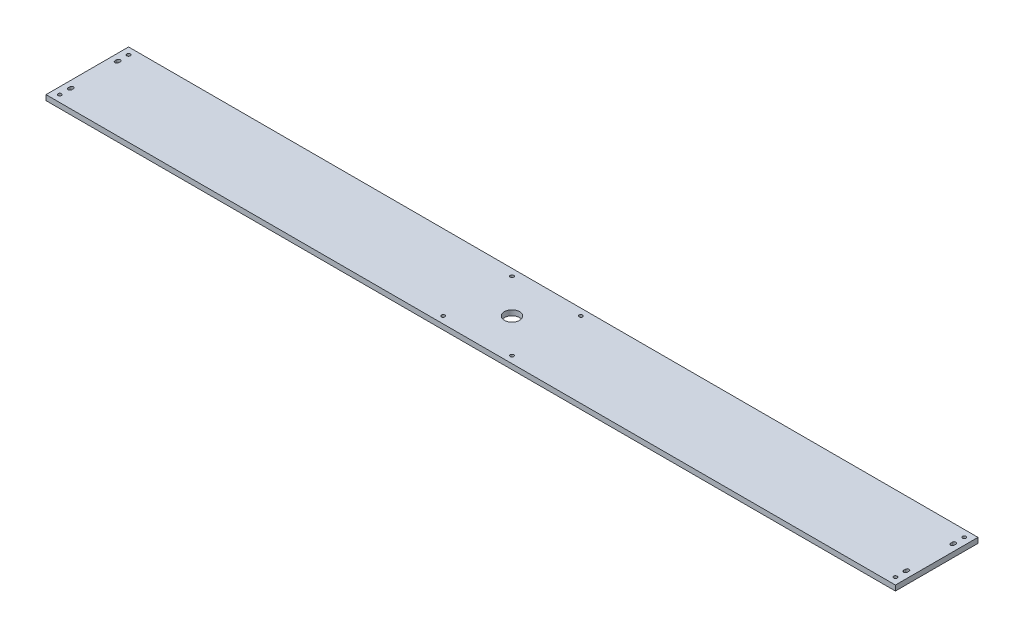
ISO-10303-21;
HEADER;
FILE_DESCRIPTION(('STEP AP214'),'2;1');
FILE_NAME('part.step','',(''),(''),'','','');
FILE_SCHEMA(('AUTOMOTIVE_DESIGN { 1 0 10303 214 1 1 1 1 }'));
ENDSEC;
DATA;
#1=APPLICATION_CONTEXT('core data for automotive mechanical design processes');
#2=APPLICATION_PROTOCOL_DEFINITION('international standard','automotive_design',2000,#1);
#3=PRODUCT_CONTEXT('',#1,'mechanical');
#4=PRODUCT('Part','Part','',(#3));
#5=PRODUCT_RELATED_PRODUCT_CATEGORY('part','',(#4));
#6=PRODUCT_DEFINITION_FORMATION('','',#4);
#7=PRODUCT_DEFINITION_CONTEXT('part definition',#1,'design');
#8=PRODUCT_DEFINITION('design','',#6,#7);
#9=PRODUCT_DEFINITION_SHAPE('','',#8);
#10=(LENGTH_UNIT() NAMED_UNIT(*) SI_UNIT(.MILLI.,.METRE.));
#11=(NAMED_UNIT(*) PLANE_ANGLE_UNIT() SI_UNIT($,.RADIAN.));
#12=(NAMED_UNIT(*) SI_UNIT($,.STERADIAN.) SOLID_ANGLE_UNIT());
#13=UNCERTAINTY_MEASURE_WITH_UNIT(LENGTH_MEASURE(1.E-05),#10,'distance_accuracy_value','');
#14=(GEOMETRIC_REPRESENTATION_CONTEXT(3) GLOBAL_UNCERTAINTY_ASSIGNED_CONTEXT((#13)) GLOBAL_UNIT_ASSIGNED_CONTEXT((#10,
#11,#12)) REPRESENTATION_CONTEXT('',''));
#15=CARTESIAN_POINT('',(0.,0.,0.));
#16=DIRECTION('',(0.,0.,1.));
#17=DIRECTION('',(1.,0.,0.));
#18=AXIS2_PLACEMENT_3D('',#15,#16,#17);
#19=CARTESIAN_POINT('',(784.2921314088,9.652,-30.7739386207228));
#20=DIRECTION('',(-1.,0.,0.));
#21=DIRECTION('',(0.,0.,1.));
#22=AXIS2_PLACEMENT_3D('',#19,#20,#21);
#23=PLANE('',#22);
#24=DIRECTION('',(0.,0.,-1.));
#25=VECTOR('',#24,1.);
#26=CARTESIAN_POINT('',(784.2921314088,0.,-30.7739386207228));
#27=LINE('',#26,#25);
#28=CARTESIAN_POINT('',(784.2921314088,0.,-30.7739386207228));
#29=VERTEX_POINT('',#28);
#30=CARTESIAN_POINT('',(784.2921314088,0.,-183.173938620723));
#31=VERTEX_POINT('',#30);
#32=EDGE_CURVE('E325',#29,#31,#27,.T.);
#33=ORIENTED_EDGE('',*,*,#32,.T.);
#34=DIRECTION('',(0.,-1.,0.));
#35=VECTOR('',#34,1.);
#36=CARTESIAN_POINT('',(784.2921314088,9.652,-183.173938620723));
#37=LINE('',#36,#35);
#38=CARTESIAN_POINT('',(784.2921314088,9.652,-183.173938620723));
#39=VERTEX_POINT('',#38);
#40=EDGE_CURVE('E11',#39,#31,#37,.T.);
#41=ORIENTED_EDGE('',*,*,#40,.F.);
#42=DIRECTION('',(0.,0.,-1.));
#43=VECTOR('',#42,1.);
#44=CARTESIAN_POINT('',(784.2921314088,9.652,-30.7739386207228));
#45=LINE('',#44,#43);
#46=CARTESIAN_POINT('',(784.2921314088,9.652,-30.7739386207228));
#47=VERTEX_POINT('',#46);
#48=EDGE_CURVE('E328',#47,#39,#45,.T.);
#49=ORIENTED_EDGE('',*,*,#48,.F.);
#50=DIRECTION('',(0.,-1.,0.));
#51=VECTOR('',#50,1.);
#52=CARTESIAN_POINT('',(784.2921314088,9.652,-30.7739386207228));
#53=LINE('',#52,#51);
#54=EDGE_CURVE('E338',#47,#29,#53,.T.);
#55=ORIENTED_EDGE('',*,*,#54,.T.);
#56=EDGE_LOOP('',(#33,#41,#49,#55));
#57=FACE_BOUND('',#56,.T.);
#58=ADVANCED_FACE('F43',(#57),#23,.F.);
#59=CARTESIAN_POINT('',(-783.1418685912,9.652,-183.173938620723));
#60=DIRECTION('',(0.,0.,1.));
#61=DIRECTION('',(1.,0.,0.));
#62=AXIS2_PLACEMENT_3D('',#59,#60,#61);
#63=PLANE('',#62);
#64=DIRECTION('',(-1.,0.,0.));
#65=VECTOR('',#64,1.);
#66=CARTESIAN_POINT('',(-783.1418685912,0.,-183.173938620723));
#67=LINE('',#66,#65);
#68=CARTESIAN_POINT('',(-783.1418685912,0.,-183.173938620723));
#69=VERTEX_POINT('',#68);
#70=EDGE_CURVE('E341',#31,#69,#67,.T.);
#71=ORIENTED_EDGE('',*,*,#70,.T.);
#72=DIRECTION('',(0.,-1.,0.));
#73=VECTOR('',#72,1.);
#74=CARTESIAN_POINT('',(-783.1418685912,9.652,-183.173938620723));
#75=LINE('',#74,#73);
#76=CARTESIAN_POINT('',(-783.1418685912,9.652,-183.173938620723));
#77=VERTEX_POINT('',#76);
#78=EDGE_CURVE('E50',#77,#69,#75,.T.);
#79=ORIENTED_EDGE('',*,*,#78,.F.);
#80=DIRECTION('',(-1.,0.,0.));
#81=VECTOR('',#80,1.);
#82=CARTESIAN_POINT('',(-783.1418685912,9.652,-183.173938620723));
#83=LINE('',#82,#81);
#84=EDGE_CURVE('E331',#39,#77,#83,.T.);
#85=ORIENTED_EDGE('',*,*,#84,.F.);
#86=ORIENTED_EDGE('',*,*,#40,.T.);
#87=EDGE_LOOP('',(#71,#79,#85,#86));
#88=FACE_BOUND('',#87,.T.);
#89=ADVANCED_FACE('F370',(#88),#63,.F.);
#90=CARTESIAN_POINT('',(-783.1418685912,9.652,-30.7739386207228));
#91=DIRECTION('',(1.,0.,0.));
#92=DIRECTION('',(0.,0.,-1.));
#93=AXIS2_PLACEMENT_3D('',#90,#91,#92);
#94=PLANE('',#93);
#95=DIRECTION('',(0.,0.,1.));
#96=VECTOR('',#95,1.);
#97=CARTESIAN_POINT('',(-783.1418685912,0.,-30.7739386207228));
#98=LINE('',#97,#96);
#99=CARTESIAN_POINT('',(-783.1418685912,0.,-30.7739386207228));
#100=VERTEX_POINT('',#99);
#101=EDGE_CURVE('E343',#69,#100,#98,.T.);
#102=ORIENTED_EDGE('',*,*,#101,.T.);
#103=DIRECTION('',(0.,-1.,0.));
#104=VECTOR('',#103,1.);
#105=CARTESIAN_POINT('',(-783.1418685912,9.652,-30.7739386207228));
#106=LINE('',#105,#104);
#107=CARTESIAN_POINT('',(-783.1418685912,9.652,-30.7739386207228));
#108=VERTEX_POINT('',#107);
#109=EDGE_CURVE('E348',#108,#100,#106,.T.);
#110=ORIENTED_EDGE('',*,*,#109,.F.);
#111=DIRECTION('',(0.,0.,1.));
#112=VECTOR('',#111,1.);
#113=CARTESIAN_POINT('',(-783.1418685912,9.652,-30.7739386207228));
#114=LINE('',#113,#112);
#115=EDGE_CURVE('E334',#77,#108,#114,.T.);
#116=ORIENTED_EDGE('',*,*,#115,.F.);
#117=ORIENTED_EDGE('',*,*,#78,.T.);
#118=EDGE_LOOP('',(#102,#110,#116,#117));
#119=FACE_BOUND('',#118,.T.);
#120=ADVANCED_FACE('F355',(#119),#94,.F.);
#121=CARTESIAN_POINT('',(-783.1418685912,9.652,-30.7739386207228));
#122=DIRECTION('',(0.,0.,-1.));
#123=DIRECTION('',(-1.,0.,0.));
#124=AXIS2_PLACEMENT_3D('',#121,#122,#123);
#125=PLANE('',#124);
#126=DIRECTION('',(1.,0.,0.));
#127=VECTOR('',#126,1.);
#128=CARTESIAN_POINT('',(-783.1418685912,0.,-30.7739386207228));
#129=LINE('',#128,#127);
#130=EDGE_CURVE('E332',#100,#29,#129,.T.);
#131=ORIENTED_EDGE('',*,*,#130,.T.);
#132=ORIENTED_EDGE('',*,*,#54,.F.);
#133=DIRECTION('',(1.,0.,0.));
#134=VECTOR('',#133,1.);
#135=CARTESIAN_POINT('',(-783.1418685912,9.652,-30.7739386207228));
#136=LINE('',#135,#134);
#137=EDGE_CURVE('E336',#108,#47,#136,.T.);
#138=ORIENTED_EDGE('',*,*,#137,.F.);
#139=ORIENTED_EDGE('',*,*,#109,.T.);
#140=EDGE_LOOP('',(#131,#132,#138,#139));
#141=FACE_BOUND('',#140,.T.);
#142=ADVANCED_FACE('F364',(#141),#125,.F.);
#143=CARTESIAN_POINT('',(0.,9.652,0.));
#144=DIRECTION('',(0.,-1.,0.));
#145=DIRECTION('',(0.,0.,-1.));
#146=AXIS2_PLACEMENT_3D('',#143,#144,#145);
#147=PLANE('',#146);
#148=DIRECTION('',(0.,0.,1.));
#149=VECTOR('',#148,1.);
#150=CARTESIAN_POINT('',(768.2901314088,9.652,-65.4449386207228));
#151=LINE('',#150,#149);
#152=CARTESIAN_POINT('',(768.2901314088,9.652,-65.4449386207228));
#153=VERTEX_POINT('',#152);
#154=CARTESIAN_POINT('',(768.2901314088,9.652,-62.1429386207228));
#155=VERTEX_POINT('',#154);
#156=EDGE_CURVE('E199',#153,#155,#151,.T.);
#157=ORIENTED_EDGE('',*,*,#156,.F.);
#158=CARTESIAN_POINT('',(771.5921314088,9.652,-65.4449386207228));
#159=DIRECTION('',(0.,1.,0.));
#160=DIRECTION('',(0.,0.,1.));
#161=AXIS2_PLACEMENT_3D('',#158,#159,#160);
#162=CIRCLE('',#161,3.30200000000003);
#163=CARTESIAN_POINT('',(774.8941314088,9.652,-65.4449386207228));
#164=VERTEX_POINT('',#163);
#165=EDGE_CURVE('E57',#164,#153,#162,.T.);
#166=ORIENTED_EDGE('',*,*,#165,.F.);
#167=DIRECTION('',(0.,0.,-1.));
#168=VECTOR('',#167,1.);
#169=CARTESIAN_POINT('',(774.8941314088,9.652,-65.4449386207228));
#170=LINE('',#169,#168);
#171=CARTESIAN_POINT('',(774.8941314088,9.652,-62.1429386207228));
#172=VERTEX_POINT('',#171);
#173=EDGE_CURVE('E188',#172,#164,#170,.T.);
#174=ORIENTED_EDGE('',*,*,#173,.F.);
#175=CARTESIAN_POINT('',(771.5921314088,9.652,-62.1429386207228));
#176=DIRECTION('',(0.,1.,0.));
#177=DIRECTION('',(0.,0.,1.));
#178=AXIS2_PLACEMENT_3D('',#175,#176,#177);
#179=CIRCLE('',#178,3.30200000000003);
#180=EDGE_CURVE('E193',#155,#172,#179,.T.);
#181=ORIENTED_EDGE('',*,*,#180,.F.);
#182=EDGE_LOOP('',(#157,#166,#174,#181));
#183=FACE_BOUND('',#182,.T.);
#184=DIRECTION('',(0.,0.,-1.));
#185=VECTOR('',#184,1.);
#186=CARTESIAN_POINT('',(774.8941314088,9.652,-148.502938620723));
#187=LINE('',#186,#185);
#188=CARTESIAN_POINT('',(774.8941314088,9.652,-148.502938620723));
#189=VERTEX_POINT('',#188);
#190=CARTESIAN_POINT('',(774.8941314088,9.652,-151.804938620723));
#191=VERTEX_POINT('',#190);
#192=EDGE_CURVE('E235',#189,#191,#187,.T.);
#193=ORIENTED_EDGE('',*,*,#192,.F.);
#194=CARTESIAN_POINT('',(771.5921314088,9.652,-148.502938620723));
#195=DIRECTION('',(0.,1.,0.));
#196=DIRECTION('',(0.,0.,-1.));
#197=AXIS2_PLACEMENT_3D('',#194,#195,#196);
#198=CIRCLE('',#197,3.30200000000003);
#199=CARTESIAN_POINT('',(768.2901314088,9.652,-148.502938620723));
#200=VERTEX_POINT('',#199);
#201=EDGE_CURVE('E65',#200,#189,#198,.T.);
#202=ORIENTED_EDGE('',*,*,#201,.F.);
#203=DIRECTION('',(0.,0.,1.));
#204=VECTOR('',#203,1.);
#205=CARTESIAN_POINT('',(768.2901314088,9.652,-148.502938620723));
#206=LINE('',#205,#204);
#207=CARTESIAN_POINT('',(768.2901314088,9.652,-151.804938620723));
#208=VERTEX_POINT('',#207);
#209=EDGE_CURVE('E228',#208,#200,#206,.T.);
#210=ORIENTED_EDGE('',*,*,#209,.F.);
#211=CARTESIAN_POINT('',(771.5921314088,9.652,-151.804938620723));
#212=DIRECTION('',(0.,1.,0.));
#213=DIRECTION('',(0.,0.,-1.));
#214=AXIS2_PLACEMENT_3D('',#211,#212,#213);
#215=CIRCLE('',#214,3.30200000000003);
#216=EDGE_CURVE('E231',#191,#208,#215,.T.);
#217=ORIENTED_EDGE('',*,*,#216,.F.);
#218=EDGE_LOOP('',(#193,#202,#210,#217));
#219=FACE_BOUND('',#218,.T.);
#220=CARTESIAN_POINT('',(771.5921314088,9.652,-170.473938620723));
#221=DIRECTION('',(0.,1.,0.));
#222=DIRECTION('',(0.,0.,-1.));
#223=AXIS2_PLACEMENT_3D('',#220,#221,#222);
#224=CIRCLE('',#223,3.17500000000009);
#225=CARTESIAN_POINT('',(771.5921314088,9.652,-173.648938620723));
#226=VERTEX_POINT('',#225);
#227=EDGE_CURVE('E227',#226,#226,#224,.T.);
#228=ORIENTED_EDGE('',*,*,#227,.F.);
#229=EDGE_LOOP('',(#228));
#230=FACE_BOUND('',#229,.T.);
#231=CARTESIAN_POINT('',(0.575131408800278,9.652,-106.973938620723));
#232=DIRECTION('',(0.,1.,0.));
#233=DIRECTION('',(0.,0.,1.));
#234=AXIS2_PLACEMENT_3D('',#231,#232,#233);
#235=CIRCLE('',#234,13.97);
#236=CARTESIAN_POINT('',(0.575131408800278,9.652,-93.0039386207228));
#237=VERTEX_POINT('',#236);
#238=EDGE_CURVE('E492',#237,#237,#235,.T.);
#239=ORIENTED_EDGE('',*,*,#238,.F.);
#240=EDGE_LOOP('',(#239));
#241=FACE_BOUND('',#240,.T.);
#242=CARTESIAN_POINT('',(771.5921314088,9.652,-43.4739386207228));
#243=DIRECTION('',(0.,1.,0.));
#244=DIRECTION('',(0.,0.,1.));
#245=AXIS2_PLACEMENT_3D('',#242,#243,#244);
#246=CIRCLE('',#245,3.17500000000009);
#247=CARTESIAN_POINT('',(771.5921314088,9.652,-40.2989386207227));
#248=VERTEX_POINT('',#247);
#249=EDGE_CURVE('E203',#248,#248,#246,.T.);
#250=ORIENTED_EDGE('',*,*,#249,.F.);
#251=EDGE_LOOP('',(#250));
#252=FACE_BOUND('',#251,.T.);
#253=CARTESIAN_POINT('',(-770.4418685912,9.652,-43.4739386207228));
#254=DIRECTION('',(0.,1.,0.));
#255=DIRECTION('',(0.,0.,-1.));
#256=AXIS2_PLACEMENT_3D('',#253,#254,#255);
#257=CIRCLE('',#256,3.17500000000009);
#258=CARTESIAN_POINT('',(-770.4418685912,9.652,-46.6489386207229));
#259=VERTEX_POINT('',#258);
#260=EDGE_CURVE('E293',#259,#259,#257,.T.);
#261=ORIENTED_EDGE('',*,*,#260,.F.);
#262=EDGE_LOOP('',(#261));
#263=FACE_BOUND('',#262,.T.);
#264=DIRECTION('',(0.,0.,1.));
#265=VECTOR('',#264,1.);
#266=CARTESIAN_POINT('',(-773.7438685912,9.652,-65.4449386207228));
#267=LINE('',#266,#265);
#268=CARTESIAN_POINT('',(-773.7438685912,9.652,-65.4449386207228));
#269=VERTEX_POINT('',#268);
#270=CARTESIAN_POINT('',(-773.7438685912,9.652,-62.1429386207228));
#271=VERTEX_POINT('',#270);
#272=EDGE_CURVE('E301',#269,#271,#267,.T.);
#273=ORIENTED_EDGE('',*,*,#272,.F.);
#274=CARTESIAN_POINT('',(-770.4418685912,9.652,-65.4449386207228));
#275=DIRECTION('',(0.,1.,0.));
#276=DIRECTION('',(0.,0.,-1.));
#277=AXIS2_PLACEMENT_3D('',#274,#275,#276);
#278=CIRCLE('',#277,3.30200000000003);
#279=CARTESIAN_POINT('',(-767.1398685912,9.652,-65.4449386207228));
#280=VERTEX_POINT('',#279);
#281=EDGE_CURVE('E259',#280,#269,#278,.T.);
#282=ORIENTED_EDGE('',*,*,#281,.F.);
#283=DIRECTION('',(0.,0.,-1.));
#284=VECTOR('',#283,1.);
#285=CARTESIAN_POINT('',(-767.1398685912,9.652,-65.4449386207228));
#286=LINE('',#285,#284);
#287=CARTESIAN_POINT('',(-767.1398685912,9.652,-62.1429386207228));
#288=VERTEX_POINT('',#287);
#289=EDGE_CURVE('E294',#288,#280,#286,.T.);
#290=ORIENTED_EDGE('',*,*,#289,.F.);
#291=CARTESIAN_POINT('',(-770.4418685912,9.652,-62.1429386207228));
#292=DIRECTION('',(0.,1.,0.));
#293=DIRECTION('',(0.,0.,-1.));
#294=AXIS2_PLACEMENT_3D('',#291,#292,#293);
#295=CIRCLE('',#294,3.30200000000003);
#296=EDGE_CURVE('E297',#271,#288,#295,.T.);
#297=ORIENTED_EDGE('',*,*,#296,.F.);
#298=EDGE_LOOP('',(#273,#282,#290,#297));
#299=FACE_BOUND('',#298,.T.);
#300=DIRECTION('',(0.,0.,-1.));
#301=VECTOR('',#300,1.);
#302=CARTESIAN_POINT('',(-767.1398685912,9.652,-148.502938620723));
#303=LINE('',#302,#301);
#304=CARTESIAN_POINT('',(-767.1398685912,9.652,-148.502938620723));
#305=VERTEX_POINT('',#304);
#306=CARTESIAN_POINT('',(-767.1398685912,9.652,-151.804938620723));
#307=VERTEX_POINT('',#306);
#308=EDGE_CURVE('E267',#305,#307,#303,.T.);
#309=ORIENTED_EDGE('',*,*,#308,.F.);
#310=CARTESIAN_POINT('',(-770.4418685912,9.652,-148.502938620723));
#311=DIRECTION('',(0.,1.,0.));
#312=DIRECTION('',(0.,0.,1.));
#313=AXIS2_PLACEMENT_3D('',#310,#311,#312);
#314=CIRCLE('',#313,3.30200000000003);
#315=CARTESIAN_POINT('',(-773.7438685912,9.652,-148.502938620723));
#316=VERTEX_POINT('',#315);
#317=EDGE_CURVE('E270',#316,#305,#314,.T.);
#318=ORIENTED_EDGE('',*,*,#317,.F.);
#319=DIRECTION('',(0.,0.,1.));
#320=VECTOR('',#319,1.);
#321=CARTESIAN_POINT('',(-773.7438685912,9.652,-148.502938620723));
#322=LINE('',#321,#320);
#323=CARTESIAN_POINT('',(-773.7438685912,9.652,-151.804938620723));
#324=VERTEX_POINT('',#323);
#325=EDGE_CURVE('E260',#324,#316,#322,.T.);
#326=ORIENTED_EDGE('',*,*,#325,.F.);
#327=CARTESIAN_POINT('',(-770.4418685912,9.652,-151.804938620723));
#328=DIRECTION('',(0.,1.,0.));
#329=DIRECTION('',(0.,0.,1.));
#330=AXIS2_PLACEMENT_3D('',#327,#328,#329);
#331=CIRCLE('',#330,3.30200000000003);
#332=EDGE_CURVE('E263',#307,#324,#331,.T.);
#333=ORIENTED_EDGE('',*,*,#332,.F.);
#334=EDGE_LOOP('',(#309,#318,#326,#333));
#335=FACE_BOUND('',#334,.T.);
#336=CARTESIAN_POINT('',(-62.9248685911998,9.652,-170.473938620723));
#337=DIRECTION('',(0.,1.,0.));
#338=DIRECTION('',(0.,0.,1.));
#339=AXIS2_PLACEMENT_3D('',#336,#337,#338);
#340=CIRCLE('',#339,3.175);
#341=CARTESIAN_POINT('',(-62.9248685911998,9.652,-167.298938620723));
#342=VERTEX_POINT('',#341);
#343=EDGE_CURVE('E487',#342,#342,#340,.T.);
#344=ORIENTED_EDGE('',*,*,#343,.F.);
#345=EDGE_LOOP('',(#344));
#346=FACE_BOUND('',#345,.T.);
#347=CARTESIAN_POINT('',(-62.9248685911998,9.652,-43.4739386207228));
#348=DIRECTION('',(0.,1.,0.));
#349=DIRECTION('',(0.,0.,-1.));
#350=AXIS2_PLACEMENT_3D('',#347,#348,#349);
#351=CIRCLE('',#350,3.175);
#352=CARTESIAN_POINT('',(-62.9248685911998,9.652,-46.6489386207228));
#353=VERTEX_POINT('',#352);
#354=EDGE_CURVE('E494',#353,#353,#351,.T.);
#355=ORIENTED_EDGE('',*,*,#354,.F.);
#356=EDGE_LOOP('',(#355));
#357=FACE_BOUND('',#356,.T.);
#358=CARTESIAN_POINT('',(64.0751314088004,9.652,-43.4739386207228));
#359=DIRECTION('',(0.,1.,0.));
#360=DIRECTION('',(0.,0.,1.));
#361=AXIS2_PLACEMENT_3D('',#358,#359,#360);
#362=CIRCLE('',#361,3.175);
#363=CARTESIAN_POINT('',(64.0751314088004,9.652,-40.2989386207228));
#364=VERTEX_POINT('',#363);
#365=EDGE_CURVE('E502',#364,#364,#362,.T.);
#366=ORIENTED_EDGE('',*,*,#365,.F.);
#367=EDGE_LOOP('',(#366));
#368=FACE_BOUND('',#367,.T.);
#369=CARTESIAN_POINT('',(64.0751314088004,9.652,-170.473938620723));
#370=DIRECTION('',(0.,1.,0.));
#371=DIRECTION('',(0.,0.,-1.));
#372=AXIS2_PLACEMENT_3D('',#369,#370,#371);
#373=CIRCLE('',#372,3.175);
#374=CARTESIAN_POINT('',(64.0751314088004,9.652,-173.648938620723));
#375=VERTEX_POINT('',#374);
#376=EDGE_CURVE('E508',#375,#375,#373,.T.);
#377=ORIENTED_EDGE('',*,*,#376,.F.);
#378=EDGE_LOOP('',(#377));
#379=FACE_BOUND('',#378,.T.);
#380=CARTESIAN_POINT('',(-770.4418685912,9.652,-170.473938620723));
#381=DIRECTION('',(0.,1.,0.));
#382=DIRECTION('',(0.,0.,1.));
#383=AXIS2_PLACEMENT_3D('',#380,#381,#382);
#384=CIRCLE('',#383,3.17500000000009);
#385=CARTESIAN_POINT('',(-770.4418685912,9.652,-167.298938620723));
#386=VERTEX_POINT('',#385);
#387=EDGE_CURVE('E272',#386,#386,#384,.T.);
#388=ORIENTED_EDGE('',*,*,#387,.F.);
#389=EDGE_LOOP('',(#388));
#390=FACE_BOUND('',#389,.T.);
#391=ORIENTED_EDGE('',*,*,#48,.T.);
#392=ORIENTED_EDGE('',*,*,#84,.T.);
#393=ORIENTED_EDGE('',*,*,#115,.T.);
#394=ORIENTED_EDGE('',*,*,#137,.T.);
#395=EDGE_LOOP('',(#391,#392,#393,#394));
#396=FACE_BOUND('',#395,.T.);
#397=ADVANCED_FACE('F196',(#183,#219,#230,#241,#252,#263,#299,#335,#346,#357,#368,#379,#390,
#396),#147,.F.);
#398=CARTESIAN_POINT('',(0.,0.,0.));
#399=DIRECTION('',(0.,-1.,0.));
#400=DIRECTION('',(0.,0.,-1.));
#401=AXIS2_PLACEMENT_3D('',#398,#399,#400);
#402=PLANE('',#401);
#403=CARTESIAN_POINT('',(771.5921314088,0.,-65.4449386207228));
#404=DIRECTION('',(0.,1.,0.));
#405=DIRECTION('',(0.,0.,1.));
#406=AXIS2_PLACEMENT_3D('',#403,#404,#405);
#407=CIRCLE('',#406,3.30200000000003);
#408=CARTESIAN_POINT('',(774.8941314088,0.,-65.4449386207228));
#409=VERTEX_POINT('',#408);
#410=CARTESIAN_POINT('',(768.2901314088,0.,-65.4449386207228));
#411=VERTEX_POINT('',#410);
#412=EDGE_CURVE('E181',#409,#411,#407,.T.);
#413=ORIENTED_EDGE('',*,*,#412,.T.);
#414=DIRECTION('',(0.,0.,1.));
#415=VECTOR('',#414,1.);
#416=CARTESIAN_POINT('',(768.2901314088,0.,-65.4449386207228));
#417=LINE('',#416,#415);
#418=CARTESIAN_POINT('',(768.2901314088,0.,-62.1429386207228));
#419=VERTEX_POINT('',#418);
#420=EDGE_CURVE('E214',#411,#419,#417,.T.);
#421=ORIENTED_EDGE('',*,*,#420,.T.);
#422=CARTESIAN_POINT('',(771.5921314088,0.,-62.1429386207228));
#423=DIRECTION('',(0.,1.,0.));
#424=DIRECTION('',(0.,0.,1.));
#425=AXIS2_PLACEMENT_3D('',#422,#423,#424);
#426=CIRCLE('',#425,3.30200000000003);
#427=CARTESIAN_POINT('',(774.8941314088,0.,-62.1429386207228));
#428=VERTEX_POINT('',#427);
#429=EDGE_CURVE('E210',#419,#428,#426,.T.);
#430=ORIENTED_EDGE('',*,*,#429,.T.);
#431=DIRECTION('',(0.,0.,-1.));
#432=VECTOR('',#431,1.);
#433=CARTESIAN_POINT('',(774.8941314088,0.,-65.4449386207228));
#434=LINE('',#433,#432);
#435=EDGE_CURVE('E208',#428,#409,#434,.T.);
#436=ORIENTED_EDGE('',*,*,#435,.T.);
#437=EDGE_LOOP('',(#413,#421,#430,#436));
#438=FACE_BOUND('',#437,.T.);
#439=CARTESIAN_POINT('',(771.5921314088,0.,-148.502938620723));
#440=DIRECTION('',(0.,1.,0.));
#441=DIRECTION('',(0.,0.,-1.));
#442=AXIS2_PLACEMENT_3D('',#439,#440,#441);
#443=CIRCLE('',#442,3.30200000000003);
#444=CARTESIAN_POINT('',(768.2901314088,0.,-148.502938620723));
#445=VERTEX_POINT('',#444);
#446=CARTESIAN_POINT('',(774.8941314088,0.,-148.502938620723));
#447=VERTEX_POINT('',#446);
#448=EDGE_CURVE('E232',#445,#447,#443,.T.);
#449=ORIENTED_EDGE('',*,*,#448,.T.);
#450=DIRECTION('',(0.,0.,-1.));
#451=VECTOR('',#450,1.);
#452=CARTESIAN_POINT('',(774.8941314088,0.,-148.502938620723));
#453=LINE('',#452,#451);
#454=CARTESIAN_POINT('',(774.8941314088,0.,-151.804938620723));
#455=VERTEX_POINT('',#454);
#456=EDGE_CURVE('E244',#447,#455,#453,.T.);
#457=ORIENTED_EDGE('',*,*,#456,.T.);
#458=CARTESIAN_POINT('',(771.5921314088,0.,-151.804938620723));
#459=DIRECTION('',(0.,1.,0.));
#460=DIRECTION('',(0.,0.,-1.));
#461=AXIS2_PLACEMENT_3D('',#458,#459,#460);
#462=CIRCLE('',#461,3.30200000000003);
#463=CARTESIAN_POINT('',(768.2901314088,0.,-151.804938620723));
#464=VERTEX_POINT('',#463);
#465=EDGE_CURVE('E241',#455,#464,#462,.T.);
#466=ORIENTED_EDGE('',*,*,#465,.T.);
#467=DIRECTION('',(0.,0.,1.));
#468=VECTOR('',#467,1.);
#469=CARTESIAN_POINT('',(768.2901314088,0.,-148.502938620723));
#470=LINE('',#469,#468);
#471=EDGE_CURVE('E220',#464,#445,#470,.T.);
#472=ORIENTED_EDGE('',*,*,#471,.T.);
#473=EDGE_LOOP('',(#449,#457,#466,#472));
#474=FACE_BOUND('',#473,.T.);
#475=CARTESIAN_POINT('',(771.5921314088,0.,-170.473938620723));
#476=DIRECTION('',(0.,1.,0.));
#477=DIRECTION('',(0.,0.,-1.));
#478=AXIS2_PLACEMENT_3D('',#475,#476,#477);
#479=CIRCLE('',#478,3.17500000000009);
#480=CARTESIAN_POINT('',(771.5921314088,0.,-173.648938620723));
#481=VERTEX_POINT('',#480);
#482=EDGE_CURVE('E516',#481,#481,#479,.T.);
#483=ORIENTED_EDGE('',*,*,#482,.T.);
#484=EDGE_LOOP('',(#483));
#485=FACE_BOUND('',#484,.T.);
#486=CARTESIAN_POINT('',(0.575131408800278,0.,-106.973938620723));
#487=DIRECTION('',(0.,1.,0.));
#488=DIRECTION('',(0.,0.,1.));
#489=AXIS2_PLACEMENT_3D('',#486,#487,#488);
#490=CIRCLE('',#489,13.97);
#491=CARTESIAN_POINT('',(0.575131408800278,0.,-93.0039386207228));
#492=VERTEX_POINT('',#491);
#493=EDGE_CURVE('E489',#492,#492,#490,.T.);
#494=ORIENTED_EDGE('',*,*,#493,.T.);
#495=EDGE_LOOP('',(#494));
#496=FACE_BOUND('',#495,.T.);
#497=CARTESIAN_POINT('',(771.5921314088,0.,-43.4739386207228));
#498=DIRECTION('',(0.,1.,0.));
#499=DIRECTION('',(0.,0.,1.));
#500=AXIS2_PLACEMENT_3D('',#497,#498,#499);
#501=CIRCLE('',#500,3.17500000000009);
#502=CARTESIAN_POINT('',(771.5921314088,0.,-40.2989386207227));
#503=VERTEX_POINT('',#502);
#504=EDGE_CURVE('E200',#503,#503,#501,.T.);
#505=ORIENTED_EDGE('',*,*,#504,.T.);
#506=EDGE_LOOP('',(#505));
#507=FACE_BOUND('',#506,.T.);
#508=CARTESIAN_POINT('',(-770.4418685912,0.,-43.4739386207228));
#509=DIRECTION('',(0.,1.,0.));
#510=DIRECTION('',(0.,0.,-1.));
#511=AXIS2_PLACEMENT_3D('',#508,#509,#510);
#512=CIRCLE('',#511,3.17500000000009);
#513=CARTESIAN_POINT('',(-770.4418685912,0.,-46.6489386207229));
#514=VERTEX_POINT('',#513);
#515=EDGE_CURVE('E317',#514,#514,#512,.T.);
#516=ORIENTED_EDGE('',*,*,#515,.T.);
#517=EDGE_LOOP('',(#516));
#518=FACE_BOUND('',#517,.T.);
#519=CARTESIAN_POINT('',(-770.4418685912,0.,-65.4449386207228));
#520=DIRECTION('',(0.,1.,0.));
#521=DIRECTION('',(0.,0.,-1.));
#522=AXIS2_PLACEMENT_3D('',#519,#520,#521);
#523=CIRCLE('',#522,3.30200000000003);
#524=CARTESIAN_POINT('',(-767.1398685912,0.,-65.4449386207228));
#525=VERTEX_POINT('',#524);
#526=CARTESIAN_POINT('',(-773.7438685912,0.,-65.4449386207228));
#527=VERTEX_POINT('',#526);
#528=EDGE_CURVE('E298',#525,#527,#523,.T.);
#529=ORIENTED_EDGE('',*,*,#528,.T.);
#530=DIRECTION('',(0.,0.,1.));
#531=VECTOR('',#530,1.);
#532=CARTESIAN_POINT('',(-773.7438685912,0.,-65.4449386207228));
#533=LINE('',#532,#531);
#534=CARTESIAN_POINT('',(-773.7438685912,0.,-62.1429386207228));
#535=VERTEX_POINT('',#534);
#536=EDGE_CURVE('E310',#527,#535,#533,.T.);
#537=ORIENTED_EDGE('',*,*,#536,.T.);
#538=CARTESIAN_POINT('',(-770.4418685912,0.,-62.1429386207228));
#539=DIRECTION('',(0.,1.,0.));
#540=DIRECTION('',(0.,0.,-1.));
#541=AXIS2_PLACEMENT_3D('',#538,#539,#540);
#542=CIRCLE('',#541,3.30200000000003);
#543=CARTESIAN_POINT('',(-767.1398685912,0.,-62.1429386207228));
#544=VERTEX_POINT('',#543);
#545=EDGE_CURVE('E307',#535,#544,#542,.T.);
#546=ORIENTED_EDGE('',*,*,#545,.T.);
#547=DIRECTION('',(0.,0.,-1.));
#548=VECTOR('',#547,1.);
#549=CARTESIAN_POINT('',(-767.1398685912,0.,-65.4449386207228));
#550=LINE('',#549,#548);
#551=EDGE_CURVE('E286',#544,#525,#550,.T.);
#552=ORIENTED_EDGE('',*,*,#551,.T.);
#553=EDGE_LOOP('',(#529,#537,#546,#552));
#554=FACE_BOUND('',#553,.T.);
#555=CARTESIAN_POINT('',(-770.4418685912,0.,-148.502938620723));
#556=DIRECTION('',(0.,1.,0.));
#557=DIRECTION('',(0.,0.,1.));
#558=AXIS2_PLACEMENT_3D('',#555,#556,#557);
#559=CIRCLE('',#558,3.30200000000003);
#560=CARTESIAN_POINT('',(-773.7438685912,0.,-148.502938620723));
#561=VERTEX_POINT('',#560);
#562=CARTESIAN_POINT('',(-767.1398685912,0.,-148.502938620723));
#563=VERTEX_POINT('',#562);
#564=EDGE_CURVE('E264',#561,#563,#559,.T.);
#565=ORIENTED_EDGE('',*,*,#564,.T.);
#566=DIRECTION('',(0.,0.,-1.));
#567=VECTOR('',#566,1.);
#568=CARTESIAN_POINT('',(-767.1398685912,0.,-148.502938620723));
#569=LINE('',#568,#567);
#570=CARTESIAN_POINT('',(-767.1398685912,0.,-151.804938620723));
#571=VERTEX_POINT('',#570);
#572=EDGE_CURVE('E278',#563,#571,#569,.T.);
#573=ORIENTED_EDGE('',*,*,#572,.T.);
#574=CARTESIAN_POINT('',(-770.4418685912,0.,-151.804938620723));
#575=DIRECTION('',(0.,1.,0.));
#576=DIRECTION('',(0.,0.,1.));
#577=AXIS2_PLACEMENT_3D('',#574,#575,#576);
#578=CIRCLE('',#577,3.30200000000003);
#579=CARTESIAN_POINT('',(-773.7438685912,0.,-151.804938620723));
#580=VERTEX_POINT('',#579);
#581=EDGE_CURVE('E275',#571,#580,#578,.T.);
#582=ORIENTED_EDGE('',*,*,#581,.T.);
#583=DIRECTION('',(0.,0.,1.));
#584=VECTOR('',#583,1.);
#585=CARTESIAN_POINT('',(-773.7438685912,0.,-148.502938620723));
#586=LINE('',#585,#584);
#587=EDGE_CURVE('E252',#580,#561,#586,.T.);
#588=ORIENTED_EDGE('',*,*,#587,.T.);
#589=EDGE_LOOP('',(#565,#573,#582,#588));
#590=FACE_BOUND('',#589,.T.);
#591=CARTESIAN_POINT('',(-62.9248685911998,0.,-170.473938620723));
#592=DIRECTION('',(0.,1.,0.));
#593=DIRECTION('',(0.,0.,1.));
#594=AXIS2_PLACEMENT_3D('',#591,#592,#593);
#595=CIRCLE('',#594,3.175);
#596=CARTESIAN_POINT('',(-62.9248685911998,0.,-167.298938620723));
#597=VERTEX_POINT('',#596);
#598=EDGE_CURVE('E484',#597,#597,#595,.T.);
#599=ORIENTED_EDGE('',*,*,#598,.T.);
#600=EDGE_LOOP('',(#599));
#601=FACE_BOUND('',#600,.T.);
#602=CARTESIAN_POINT('',(-62.9248685911998,0.,-43.4739386207228));
#603=DIRECTION('',(0.,1.,0.));
#604=DIRECTION('',(0.,0.,-1.));
#605=AXIS2_PLACEMENT_3D('',#602,#603,#604);
#606=CIRCLE('',#605,3.175);
#607=CARTESIAN_POINT('',(-62.9248685911998,0.,-46.6489386207228));
#608=VERTEX_POINT('',#607);
#609=EDGE_CURVE('E499',#608,#608,#606,.T.);
#610=ORIENTED_EDGE('',*,*,#609,.T.);
#611=EDGE_LOOP('',(#610));
#612=FACE_BOUND('',#611,.T.);
#613=CARTESIAN_POINT('',(64.0751314088004,0.,-43.4739386207228));
#614=DIRECTION('',(0.,1.,0.));
#615=DIRECTION('',(0.,0.,1.));
#616=AXIS2_PLACEMENT_3D('',#613,#614,#615);
#617=CIRCLE('',#616,3.175);
#618=CARTESIAN_POINT('',(64.0751314088004,0.,-40.2989386207228));
#619=VERTEX_POINT('',#618);
#620=EDGE_CURVE('E505',#619,#619,#617,.T.);
#621=ORIENTED_EDGE('',*,*,#620,.T.);
#622=EDGE_LOOP('',(#621));
#623=FACE_BOUND('',#622,.T.);
#624=CARTESIAN_POINT('',(64.0751314088004,0.,-170.473938620723));
#625=DIRECTION('',(0.,1.,0.));
#626=DIRECTION('',(0.,0.,-1.));
#627=AXIS2_PLACEMENT_3D('',#624,#625,#626);
#628=CIRCLE('',#627,3.175);
#629=CARTESIAN_POINT('',(64.0751314088004,0.,-173.648938620723));
#630=VERTEX_POINT('',#629);
#631=EDGE_CURVE('E511',#630,#630,#628,.T.);
#632=ORIENTED_EDGE('',*,*,#631,.T.);
#633=EDGE_LOOP('',(#632));
#634=FACE_BOUND('',#633,.T.);
#635=CARTESIAN_POINT('',(-770.4418685912,0.,-170.473938620723));
#636=DIRECTION('',(0.,1.,0.));
#637=DIRECTION('',(0.,0.,1.));
#638=AXIS2_PLACEMENT_3D('',#635,#636,#637);
#639=CIRCLE('',#638,3.17500000000009);
#640=CARTESIAN_POINT('',(-770.4418685912,0.,-167.298938620723));
#641=VERTEX_POINT('',#640);
#642=EDGE_CURVE('E322',#641,#641,#639,.T.);
#643=ORIENTED_EDGE('',*,*,#642,.T.);
#644=EDGE_LOOP('',(#643));
#645=FACE_BOUND('',#644,.T.);
#646=ORIENTED_EDGE('',*,*,#32,.F.);
#647=ORIENTED_EDGE('',*,*,#130,.F.);
#648=ORIENTED_EDGE('',*,*,#101,.F.);
#649=ORIENTED_EDGE('',*,*,#70,.F.);
#650=EDGE_LOOP('',(#646,#647,#648,#649));
#651=FACE_BOUND('',#650,.T.);
#652=ADVANCED_FACE('F361',(#438,#474,#485,#496,#507,#518,#554,#590,#601,#612,#623,#634,#645,
#651),#402,.T.);
#653=CARTESIAN_POINT('',(-770.4418685912,0.,-170.473938620723));
#654=DIRECTION('',(0.,1.,0.));
#655=DIRECTION('',(0.,0.,1.));
#656=AXIS2_PLACEMENT_3D('',#653,#654,#655);
#657=CYLINDRICAL_SURFACE('',#656,3.17500000000009);
#658=ORIENTED_EDGE('',*,*,#642,.F.);
#659=EDGE_LOOP('',(#658));
#660=FACE_BOUND('',#659,.T.);
#661=ORIENTED_EDGE('',*,*,#387,.T.);
#662=EDGE_LOOP('',(#661));
#663=FACE_BOUND('',#662,.T.);
#664=ADVANCED_FACE('F382',(#660,#663),#657,.F.);
#665=CARTESIAN_POINT('',(64.0751314088004,0.,-170.473938620723));
#666=DIRECTION('',(0.,1.,0.));
#667=DIRECTION('',(0.,0.,1.));
#668=AXIS2_PLACEMENT_3D('',#665,#666,#667);
#669=CYLINDRICAL_SURFACE('',#668,3.175);
#670=ORIENTED_EDGE('',*,*,#631,.F.);
#671=EDGE_LOOP('',(#670));
#672=FACE_BOUND('',#671,.T.);
#673=ORIENTED_EDGE('',*,*,#376,.T.);
#674=EDGE_LOOP('',(#673));
#675=FACE_BOUND('',#674,.T.);
#676=ADVANCED_FACE('F388',(#672,#675),#669,.F.);
#677=CARTESIAN_POINT('',(64.0751314088004,0.,-43.4739386207228));
#678=DIRECTION('',(0.,1.,0.));
#679=DIRECTION('',(0.,0.,1.));
#680=AXIS2_PLACEMENT_3D('',#677,#678,#679);
#681=CYLINDRICAL_SURFACE('',#680,3.175);
#682=ORIENTED_EDGE('',*,*,#620,.F.);
#683=EDGE_LOOP('',(#682));
#684=FACE_BOUND('',#683,.T.);
#685=ORIENTED_EDGE('',*,*,#365,.T.);
#686=EDGE_LOOP('',(#685));
#687=FACE_BOUND('',#686,.T.);
#688=ADVANCED_FACE('F468',(#684,#687),#681,.F.);
#689=CARTESIAN_POINT('',(-62.9248685911998,0.,-43.4739386207228));
#690=DIRECTION('',(0.,1.,0.));
#691=DIRECTION('',(0.,0.,1.));
#692=AXIS2_PLACEMENT_3D('',#689,#690,#691);
#693=CYLINDRICAL_SURFACE('',#692,3.175);
#694=ORIENTED_EDGE('',*,*,#609,.F.);
#695=EDGE_LOOP('',(#694));
#696=FACE_BOUND('',#695,.T.);
#697=ORIENTED_EDGE('',*,*,#354,.T.);
#698=EDGE_LOOP('',(#697));
#699=FACE_BOUND('',#698,.T.);
#700=ADVANCED_FACE('F472',(#696,#699),#693,.F.);
#701=CARTESIAN_POINT('',(-62.9248685911998,0.,-170.473938620723));
#702=DIRECTION('',(0.,1.,0.));
#703=DIRECTION('',(0.,0.,1.));
#704=AXIS2_PLACEMENT_3D('',#701,#702,#703);
#705=CYLINDRICAL_SURFACE('',#704,3.175);
#706=ORIENTED_EDGE('',*,*,#598,.F.);
#707=EDGE_LOOP('',(#706));
#708=FACE_BOUND('',#707,.T.);
#709=ORIENTED_EDGE('',*,*,#343,.T.);
#710=EDGE_LOOP('',(#709));
#711=FACE_BOUND('',#710,.T.);
#712=ADVANCED_FACE('F430',(#708,#711),#705,.F.);
#713=CARTESIAN_POINT('',(-770.4418685912,0.,-148.502938620723));
#714=DIRECTION('',(0.,1.,0.));
#715=DIRECTION('',(0.,0.,1.));
#716=AXIS2_PLACEMENT_3D('',#713,#714,#715);
#717=CYLINDRICAL_SURFACE('',#716,3.30200000000003);
#718=ORIENTED_EDGE('',*,*,#317,.T.);
#719=DIRECTION('',(0.,1.,0.));
#720=VECTOR('',#719,1.);
#721=CARTESIAN_POINT('',(-767.1398685912,0.,-148.502938620723));
#722=LINE('',#721,#720);
#723=EDGE_CURVE('E249',#563,#305,#722,.T.);
#724=ORIENTED_EDGE('',*,*,#723,.F.);
#725=ORIENTED_EDGE('',*,*,#564,.F.);
#726=DIRECTION('',(0.,1.,0.));
#727=VECTOR('',#726,1.);
#728=CARTESIAN_POINT('',(-773.7438685912,0.,-148.502938620723));
#729=LINE('',#728,#727);
#730=EDGE_CURVE('E257',#561,#316,#729,.T.);
#731=ORIENTED_EDGE('',*,*,#730,.T.);
#732=EDGE_LOOP('',(#718,#724,#725,#731));
#733=FACE_BOUND('',#732,.T.);
#734=ADVANCED_FACE('F420',(#733),#717,.F.);
#735=CARTESIAN_POINT('',(-773.7438685912,0.,-148.502938620723));
#736=DIRECTION('',(-1.,0.,0.));
#737=DIRECTION('',(0.,0.,1.));
#738=AXIS2_PLACEMENT_3D('',#735,#736,#737);
#739=PLANE('',#738);
#740=ORIENTED_EDGE('',*,*,#325,.T.);
#741=ORIENTED_EDGE('',*,*,#730,.F.);
#742=ORIENTED_EDGE('',*,*,#587,.F.);
#743=DIRECTION('',(0.,1.,0.));
#744=VECTOR('',#743,1.);
#745=CARTESIAN_POINT('',(-773.7438685912,0.,-151.804938620723));
#746=LINE('',#745,#744);
#747=EDGE_CURVE('E255',#580,#324,#746,.T.);
#748=ORIENTED_EDGE('',*,*,#747,.T.);
#749=EDGE_LOOP('',(#740,#741,#742,#748));
#750=FACE_BOUND('',#749,.T.);
#751=ADVANCED_FACE('F416',(#750),#739,.F.);
#752=CARTESIAN_POINT('',(-770.4418685912,0.,-151.804938620723));
#753=DIRECTION('',(0.,1.,0.));
#754=DIRECTION('',(0.,0.,1.));
#755=AXIS2_PLACEMENT_3D('',#752,#753,#754);
#756=CYLINDRICAL_SURFACE('',#755,3.30200000000003);
#757=ORIENTED_EDGE('',*,*,#332,.T.);
#758=ORIENTED_EDGE('',*,*,#747,.F.);
#759=ORIENTED_EDGE('',*,*,#581,.F.);
#760=DIRECTION('',(0.,1.,0.));
#761=VECTOR('',#760,1.);
#762=CARTESIAN_POINT('',(-767.1398685912,0.,-151.804938620723));
#763=LINE('',#762,#761);
#764=EDGE_CURVE('E253',#571,#307,#763,.T.);
#765=ORIENTED_EDGE('',*,*,#764,.T.);
#766=EDGE_LOOP('',(#757,#758,#759,#765));
#767=FACE_BOUND('',#766,.T.);
#768=ADVANCED_FACE('F419',(#767),#756,.F.);
#769=CARTESIAN_POINT('',(-767.1398685912,0.,-148.502938620723));
#770=DIRECTION('',(1.,0.,0.));
#771=DIRECTION('',(0.,0.,-1.));
#772=AXIS2_PLACEMENT_3D('',#769,#770,#771);
#773=PLANE('',#772);
#774=ORIENTED_EDGE('',*,*,#308,.T.);
#775=ORIENTED_EDGE('',*,*,#764,.F.);
#776=ORIENTED_EDGE('',*,*,#572,.F.);
#777=ORIENTED_EDGE('',*,*,#723,.T.);
#778=EDGE_LOOP('',(#774,#775,#776,#777));
#779=FACE_BOUND('',#778,.T.);
#780=ADVANCED_FACE('F414',(#779),#773,.F.);
#781=CARTESIAN_POINT('',(-770.4418685912,0.,-65.4449386207228));
#782=DIRECTION('',(0.,1.,0.));
#783=DIRECTION('',(0.,0.,1.));
#784=AXIS2_PLACEMENT_3D('',#781,#782,#783);
#785=CYLINDRICAL_SURFACE('',#784,3.30200000000003);
#786=ORIENTED_EDGE('',*,*,#281,.T.);
#787=DIRECTION('',(0.,1.,0.));
#788=VECTOR('',#787,1.);
#789=CARTESIAN_POINT('',(-773.7438685912,0.,-65.4449386207228));
#790=LINE('',#789,#788);
#791=EDGE_CURVE('E283',#527,#269,#790,.T.);
#792=ORIENTED_EDGE('',*,*,#791,.F.);
#793=ORIENTED_EDGE('',*,*,#528,.F.);
#794=DIRECTION('',(0.,1.,0.));
#795=VECTOR('',#794,1.);
#796=CARTESIAN_POINT('',(-767.1398685912,0.,-65.4449386207228));
#797=LINE('',#796,#795);
#798=EDGE_CURVE('E291',#525,#280,#797,.T.);
#799=ORIENTED_EDGE('',*,*,#798,.T.);
#800=EDGE_LOOP('',(#786,#792,#793,#799));
#801=FACE_BOUND('',#800,.T.);
#802=ADVANCED_FACE('F404',(#801),#785,.F.);
#803=CARTESIAN_POINT('',(-767.1398685912,0.,-65.4449386207228));
#804=DIRECTION('',(1.,0.,0.));
#805=DIRECTION('',(0.,0.,-1.));
#806=AXIS2_PLACEMENT_3D('',#803,#804,#805);
#807=PLANE('',#806);
#808=ORIENTED_EDGE('',*,*,#289,.T.);
#809=ORIENTED_EDGE('',*,*,#798,.F.);
#810=ORIENTED_EDGE('',*,*,#551,.F.);
#811=DIRECTION('',(0.,1.,0.));
#812=VECTOR('',#811,1.);
#813=CARTESIAN_POINT('',(-767.1398685912,0.,-62.1429386207228));
#814=LINE('',#813,#812);
#815=EDGE_CURVE('E289',#544,#288,#814,.T.);
#816=ORIENTED_EDGE('',*,*,#815,.T.);
#817=EDGE_LOOP('',(#808,#809,#810,#816));
#818=FACE_BOUND('',#817,.T.);
#819=ADVANCED_FACE('F400',(#818),#807,.F.);
#820=CARTESIAN_POINT('',(-770.4418685912,0.,-62.1429386207228));
#821=DIRECTION('',(0.,1.,0.));
#822=DIRECTION('',(0.,0.,1.));
#823=AXIS2_PLACEMENT_3D('',#820,#821,#822);
#824=CYLINDRICAL_SURFACE('',#823,3.30200000000003);
#825=ORIENTED_EDGE('',*,*,#296,.T.);
#826=ORIENTED_EDGE('',*,*,#815,.F.);
#827=ORIENTED_EDGE('',*,*,#545,.F.);
#828=DIRECTION('',(0.,1.,0.));
#829=VECTOR('',#828,1.);
#830=CARTESIAN_POINT('',(-773.7438685912,0.,-62.1429386207228));
#831=LINE('',#830,#829);
#832=EDGE_CURVE('E287',#535,#271,#831,.T.);
#833=ORIENTED_EDGE('',*,*,#832,.T.);
#834=EDGE_LOOP('',(#825,#826,#827,#833));
#835=FACE_BOUND('',#834,.T.);
#836=ADVANCED_FACE('F403',(#835),#824,.F.);
#837=CARTESIAN_POINT('',(-773.7438685912,0.,-65.4449386207228));
#838=DIRECTION('',(-1.,0.,0.));
#839=DIRECTION('',(0.,0.,1.));
#840=AXIS2_PLACEMENT_3D('',#837,#838,#839);
#841=PLANE('',#840);
#842=ORIENTED_EDGE('',*,*,#272,.T.);
#843=ORIENTED_EDGE('',*,*,#832,.F.);
#844=ORIENTED_EDGE('',*,*,#536,.F.);
#845=ORIENTED_EDGE('',*,*,#791,.T.);
#846=EDGE_LOOP('',(#842,#843,#844,#845));
#847=FACE_BOUND('',#846,.T.);
#848=ADVANCED_FACE('F398',(#847),#841,.F.);
#849=CARTESIAN_POINT('',(-770.4418685912,0.,-43.4739386207228));
#850=DIRECTION('',(0.,1.,0.));
#851=DIRECTION('',(0.,0.,1.));
#852=AXIS2_PLACEMENT_3D('',#849,#850,#851);
#853=CYLINDRICAL_SURFACE('',#852,3.17500000000009);
#854=ORIENTED_EDGE('',*,*,#515,.F.);
#855=EDGE_LOOP('',(#854));
#856=FACE_BOUND('',#855,.T.);
#857=ORIENTED_EDGE('',*,*,#260,.T.);
#858=EDGE_LOOP('',(#857));
#859=FACE_BOUND('',#858,.T.);
#860=ADVANCED_FACE('F394',(#856,#859),#853,.F.);
#861=CARTESIAN_POINT('',(771.5921314088,0.,-43.4739386207228));
#862=DIRECTION('',(0.,1.,0.));
#863=DIRECTION('',(0.,0.,1.));
#864=AXIS2_PLACEMENT_3D('',#861,#862,#863);
#865=CYLINDRICAL_SURFACE('',#864,3.17500000000009);
#866=ORIENTED_EDGE('',*,*,#504,.F.);
#867=EDGE_LOOP('',(#866));
#868=FACE_BOUND('',#867,.T.);
#869=ORIENTED_EDGE('',*,*,#249,.T.);
#870=EDGE_LOOP('',(#869));
#871=FACE_BOUND('',#870,.T.);
#872=ADVANCED_FACE('F390',(#868,#871),#865,.F.);
#873=CARTESIAN_POINT('',(0.575131408800278,0.,-106.973938620723));
#874=DIRECTION('',(0.,1.,0.));
#875=DIRECTION('',(0.,0.,1.));
#876=AXIS2_PLACEMENT_3D('',#873,#874,#875);
#877=CYLINDRICAL_SURFACE('',#876,13.97);
#878=ORIENTED_EDGE('',*,*,#493,.F.);
#879=EDGE_LOOP('',(#878));
#880=FACE_BOUND('',#879,.T.);
#881=ORIENTED_EDGE('',*,*,#238,.T.);
#882=EDGE_LOOP('',(#881));
#883=FACE_BOUND('',#882,.T.);
#884=ADVANCED_FACE('F393',(#880,#883),#877,.F.);
#885=CARTESIAN_POINT('',(771.5921314088,0.,-170.473938620723));
#886=DIRECTION('',(0.,1.,0.));
#887=DIRECTION('',(0.,0.,1.));
#888=AXIS2_PLACEMENT_3D('',#885,#886,#887);
#889=CYLINDRICAL_SURFACE('',#888,3.17500000000009);
#890=ORIENTED_EDGE('',*,*,#482,.F.);
#891=EDGE_LOOP('',(#890));
#892=FACE_BOUND('',#891,.T.);
#893=ORIENTED_EDGE('',*,*,#227,.T.);
#894=EDGE_LOOP('',(#893));
#895=FACE_BOUND('',#894,.T.);
#896=ADVANCED_FACE('F447',(#892,#895),#889,.F.);
#897=CARTESIAN_POINT('',(771.5921314088,0.,-148.502938620723));
#898=DIRECTION('',(0.,1.,0.));
#899=DIRECTION('',(0.,0.,1.));
#900=AXIS2_PLACEMENT_3D('',#897,#898,#899);
#901=CYLINDRICAL_SURFACE('',#900,3.30200000000003);
#902=ORIENTED_EDGE('',*,*,#201,.T.);
#903=DIRECTION('',(0.,1.,0.));
#904=VECTOR('',#903,1.);
#905=CARTESIAN_POINT('',(774.8941314088,0.,-148.502938620723));
#906=LINE('',#905,#904);
#907=EDGE_CURVE('E218',#447,#189,#906,.T.);
#908=ORIENTED_EDGE('',*,*,#907,.F.);
#909=ORIENTED_EDGE('',*,*,#448,.F.);
#910=DIRECTION('',(0.,1.,0.));
#911=VECTOR('',#910,1.);
#912=CARTESIAN_POINT('',(768.2901314088,0.,-148.502938620723));
#913=LINE('',#912,#911);
#914=EDGE_CURVE('E225',#445,#200,#913,.T.);
#915=ORIENTED_EDGE('',*,*,#914,.T.);
#916=EDGE_LOOP('',(#902,#908,#909,#915));
#917=FACE_BOUND('',#916,.T.);
#918=ADVANCED_FACE('F436',(#917),#901,.F.);
#919=CARTESIAN_POINT('',(768.2901314088,0.,-148.502938620723));
#920=DIRECTION('',(-1.,0.,0.));
#921=DIRECTION('',(0.,0.,1.));
#922=AXIS2_PLACEMENT_3D('',#919,#920,#921);
#923=PLANE('',#922);
#924=ORIENTED_EDGE('',*,*,#209,.T.);
#925=ORIENTED_EDGE('',*,*,#914,.F.);
#926=ORIENTED_EDGE('',*,*,#471,.F.);
#927=DIRECTION('',(0.,1.,0.));
#928=VECTOR('',#927,1.);
#929=CARTESIAN_POINT('',(768.2901314088,0.,-151.804938620723));
#930=LINE('',#929,#928);
#931=EDGE_CURVE('E223',#464,#208,#930,.T.);
#932=ORIENTED_EDGE('',*,*,#931,.T.);
#933=EDGE_LOOP('',(#924,#925,#926,#932));
#934=FACE_BOUND('',#933,.T.);
#935=ADVANCED_FACE('F432',(#934),#923,.F.);
#936=CARTESIAN_POINT('',(771.5921314088,0.,-151.804938620723));
#937=DIRECTION('',(0.,1.,0.));
#938=DIRECTION('',(0.,0.,1.));
#939=AXIS2_PLACEMENT_3D('',#936,#937,#938);
#940=CYLINDRICAL_SURFACE('',#939,3.30200000000003);
#941=ORIENTED_EDGE('',*,*,#216,.T.);
#942=ORIENTED_EDGE('',*,*,#931,.F.);
#943=ORIENTED_EDGE('',*,*,#465,.F.);
#944=DIRECTION('',(0.,1.,0.));
#945=VECTOR('',#944,1.);
#946=CARTESIAN_POINT('',(774.8941314088,0.,-151.804938620723));
#947=LINE('',#946,#945);
#948=EDGE_CURVE('E221',#455,#191,#947,.T.);
#949=ORIENTED_EDGE('',*,*,#948,.T.);
#950=EDGE_LOOP('',(#941,#942,#943,#949));
#951=FACE_BOUND('',#950,.T.);
#952=ADVANCED_FACE('F435',(#951),#940,.F.);
#953=CARTESIAN_POINT('',(774.8941314088,0.,-148.502938620723));
#954=DIRECTION('',(1.,0.,0.));
#955=DIRECTION('',(0.,0.,-1.));
#956=AXIS2_PLACEMENT_3D('',#953,#954,#955);
#957=PLANE('',#956);
#958=ORIENTED_EDGE('',*,*,#192,.T.);
#959=ORIENTED_EDGE('',*,*,#948,.F.);
#960=ORIENTED_EDGE('',*,*,#456,.F.);
#961=ORIENTED_EDGE('',*,*,#907,.T.);
#962=EDGE_LOOP('',(#958,#959,#960,#961));
#963=FACE_BOUND('',#962,.T.);
#964=ADVANCED_FACE('F440',(#963),#957,.F.);
#965=CARTESIAN_POINT('',(771.5921314088,0.,-65.4449386207228));
#966=DIRECTION('',(0.,1.,0.));
#967=DIRECTION('',(0.,0.,1.));
#968=AXIS2_PLACEMENT_3D('',#965,#966,#967);
#969=CYLINDRICAL_SURFACE('',#968,3.30200000000003);
#970=ORIENTED_EDGE('',*,*,#165,.T.);
#971=DIRECTION('',(0.,1.,0.));
#972=VECTOR('',#971,1.);
#973=CARTESIAN_POINT('',(768.2901314088,0.,-65.4449386207228));
#974=LINE('',#973,#972);
#975=EDGE_CURVE('E211',#411,#153,#974,.T.);
#976=ORIENTED_EDGE('',*,*,#975,.F.);
#977=ORIENTED_EDGE('',*,*,#412,.F.);
#978=DIRECTION('',(0.,1.,0.));
#979=VECTOR('',#978,1.);
#980=CARTESIAN_POINT('',(774.8941314088,0.,-65.4449386207228));
#981=LINE('',#980,#979);
#982=EDGE_CURVE('E177',#409,#164,#981,.T.);
#983=ORIENTED_EDGE('',*,*,#982,.T.);
#984=EDGE_LOOP('',(#970,#976,#977,#983));
#985=FACE_BOUND('',#984,.T.);
#986=ADVANCED_FACE('F179',(#985),#969,.F.);
#987=CARTESIAN_POINT('',(774.8941314088,0.,-65.4449386207228));
#988=DIRECTION('',(1.,0.,0.));
#989=DIRECTION('',(0.,0.,-1.));
#990=AXIS2_PLACEMENT_3D('',#987,#988,#989);
#991=PLANE('',#990);
#992=ORIENTED_EDGE('',*,*,#173,.T.);
#993=ORIENTED_EDGE('',*,*,#982,.F.);
#994=ORIENTED_EDGE('',*,*,#435,.F.);
#995=DIRECTION('',(0.,1.,0.));
#996=VECTOR('',#995,1.);
#997=CARTESIAN_POINT('',(774.8941314088,0.,-62.1429386207228));
#998=LINE('',#997,#996);
#999=EDGE_CURVE('E185',#428,#172,#998,.T.);
#1000=ORIENTED_EDGE('',*,*,#999,.T.);
#1001=EDGE_LOOP('',(#992,#993,#994,#1000));
#1002=FACE_BOUND('',#1001,.T.);
#1003=ADVANCED_FACE('F189',(#1002),#991,.F.);
#1004=CARTESIAN_POINT('',(771.5921314088,0.,-62.1429386207228));
#1005=DIRECTION('',(0.,1.,0.));
#1006=DIRECTION('',(0.,0.,1.));
#1007=AXIS2_PLACEMENT_3D('',#1004,#1005,#1006);
#1008=CYLINDRICAL_SURFACE('',#1007,3.30200000000003);
#1009=ORIENTED_EDGE('',*,*,#180,.T.);
#1010=ORIENTED_EDGE('',*,*,#999,.F.);
#1011=ORIENTED_EDGE('',*,*,#429,.F.);
#1012=DIRECTION('',(0.,1.,0.));
#1013=VECTOR('',#1012,1.);
#1014=CARTESIAN_POINT('',(768.2901314088,0.,-62.1429386207228));
#1015=LINE('',#1014,#1013);
#1016=EDGE_CURVE('E522',#419,#155,#1015,.T.);
#1017=ORIENTED_EDGE('',*,*,#1016,.T.);
#1018=EDGE_LOOP('',(#1009,#1010,#1011,#1017));
#1019=FACE_BOUND('',#1018,.T.);
#1020=ADVANCED_FACE('F450',(#1019),#1008,.F.);
#1021=CARTESIAN_POINT('',(768.2901314088,0.,-65.4449386207228));
#1022=DIRECTION('',(-1.,0.,0.));
#1023=DIRECTION('',(0.,0.,1.));
#1024=AXIS2_PLACEMENT_3D('',#1021,#1022,#1023);
#1025=PLANE('',#1024);
#1026=ORIENTED_EDGE('',*,*,#156,.T.);
#1027=ORIENTED_EDGE('',*,*,#1016,.F.);
#1028=ORIENTED_EDGE('',*,*,#420,.F.);
#1029=ORIENTED_EDGE('',*,*,#975,.T.);
#1030=EDGE_LOOP('',(#1026,#1027,#1028,#1029));
#1031=FACE_BOUND('',#1030,.T.);
#1032=ADVANCED_FACE('F453',(#1031),#1025,.F.);
#1033=CLOSED_SHELL('',(#58,#89,#120,#142,#397,#652,#664,#676,#688,#700,#712,#734,#751,#768,#780,
#802,#819,#836,#848,#860,#872,#884,#896,#918,#935,#952,#964,#986,#1003,#1020,#1032));
#1034=MANIFOLD_SOLID_BREP('B2',#1033);
#1035=ADVANCED_BREP_SHAPE_REPRESENTATION('',(#18,#1034),#14);
#1036=SHAPE_DEFINITION_REPRESENTATION(#9,#1035);
ENDSEC;
END-ISO-10303-21;
